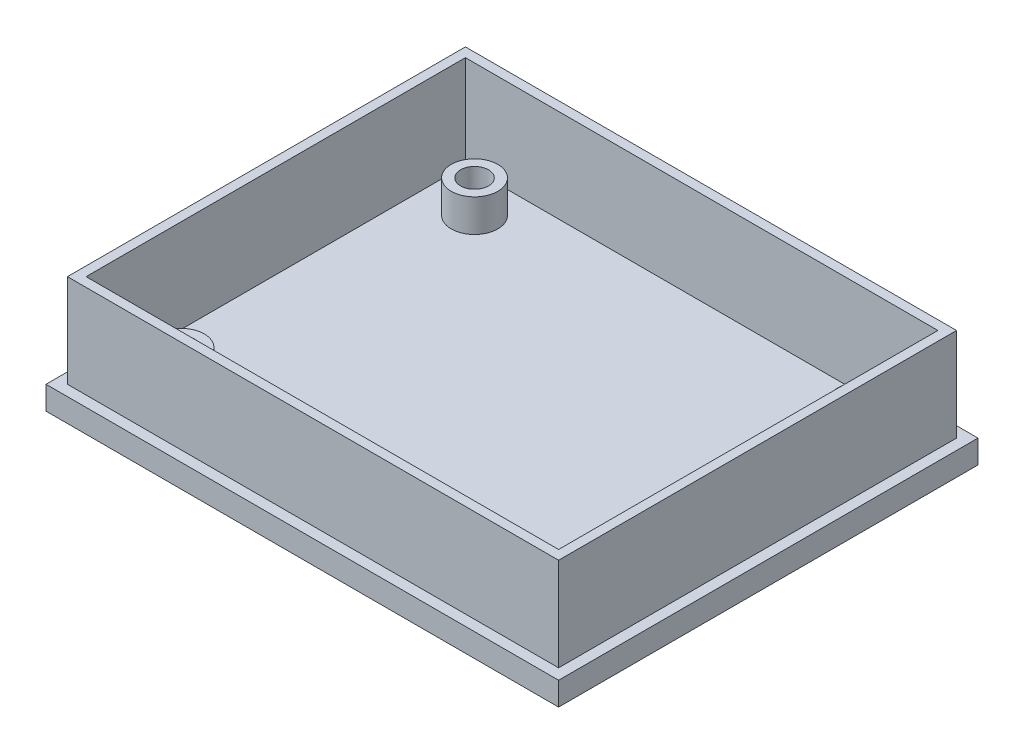
ISO-10303-21;
HEADER;
FILE_DESCRIPTION(('STEP AP214'),'2;1');
FILE_NAME('part.step','',(''),(''),'','','');
FILE_SCHEMA(('AUTOMOTIVE_DESIGN { 1 0 10303 214 1 1 1 1 }'));
ENDSEC;
DATA;
#1=APPLICATION_CONTEXT('core data for automotive mechanical design processes');
#2=APPLICATION_PROTOCOL_DEFINITION('international standard','automotive_design',2000,#1);
#3=PRODUCT_CONTEXT('',#1,'mechanical');
#4=PRODUCT('Part','Part','',(#3));
#5=PRODUCT_RELATED_PRODUCT_CATEGORY('part','',(#4));
#6=PRODUCT_DEFINITION_FORMATION('','',#4);
#7=PRODUCT_DEFINITION_CONTEXT('part definition',#1,'design');
#8=PRODUCT_DEFINITION('design','',#6,#7);
#9=PRODUCT_DEFINITION_SHAPE('','',#8);
#10=(LENGTH_UNIT() NAMED_UNIT(*) SI_UNIT(.MILLI.,.METRE.));
#11=(NAMED_UNIT(*) PLANE_ANGLE_UNIT() SI_UNIT($,.RADIAN.));
#12=(NAMED_UNIT(*) SI_UNIT($,.STERADIAN.) SOLID_ANGLE_UNIT());
#13=UNCERTAINTY_MEASURE_WITH_UNIT(LENGTH_MEASURE(1.E-05),#10,'distance_accuracy_value','');
#14=(GEOMETRIC_REPRESENTATION_CONTEXT(3) GLOBAL_UNCERTAINTY_ASSIGNED_CONTEXT((#13)) GLOBAL_UNIT_ASSIGNED_CONTEXT((#10,
#11,#12)) REPRESENTATION_CONTEXT('',''));
#15=CARTESIAN_POINT('',(0.,0.,0.));
#16=DIRECTION('',(0.,0.,1.));
#17=DIRECTION('',(1.,0.,0.));
#18=AXIS2_PLACEMENT_3D('',#15,#16,#17);
#19=CARTESIAN_POINT('',(0.,5.,0.));
#20=DIRECTION('',(0.,1.,0.));
#21=DIRECTION('',(0.,0.,1.));
#22=AXIS2_PLACEMENT_3D('',#19,#20,#21);
#23=PLANE('',#22);
#24=DIRECTION('',(-1.,0.,0.));
#25=VECTOR('',#24,1.);
#26=CARTESIAN_POINT('',(55.,5.,-45.));
#27=LINE('',#26,#25);
#28=CARTESIAN_POINT('',(55.,5.,-45.));
#29=VERTEX_POINT('',#28);
#30=CARTESIAN_POINT('',(-55.,5.,-45.));
#31=VERTEX_POINT('',#30);
#32=EDGE_CURVE('E192',#29,#31,#27,.T.);
#33=ORIENTED_EDGE('',*,*,#32,.T.);
#34=DIRECTION('',(0.,0.,1.));
#35=VECTOR('',#34,1.);
#36=CARTESIAN_POINT('',(-55.,5.,-45.));
#37=LINE('',#36,#35);
#38=CARTESIAN_POINT('',(-55.,5.,45.));
#39=VERTEX_POINT('',#38);
#40=EDGE_CURVE('E195',#31,#39,#37,.T.);
#41=ORIENTED_EDGE('',*,*,#40,.T.);
#42=DIRECTION('',(-1.,0.,0.));
#43=VECTOR('',#42,1.);
#44=CARTESIAN_POINT('',(55.,5.,45.));
#45=LINE('',#44,#43);
#46=CARTESIAN_POINT('',(55.,5.,45.));
#47=VERTEX_POINT('',#46);
#48=EDGE_CURVE('E198',#47,#39,#45,.T.);
#49=ORIENTED_EDGE('',*,*,#48,.F.);
#50=DIRECTION('',(0.,0.,1.));
#51=VECTOR('',#50,1.);
#52=CARTESIAN_POINT('',(55.,5.,-45.));
#53=LINE('',#52,#51);
#54=EDGE_CURVE('E201',#29,#47,#53,.T.);
#55=ORIENTED_EDGE('',*,*,#54,.F.);
#56=EDGE_LOOP('',(#33,#41,#49,#55));
#57=FACE_BOUND('',#56,.T.);
#58=DIRECTION('',(-1.,0.,0.));
#59=VECTOR('',#58,1.);
#60=CARTESIAN_POINT('',(52.7,5.,-42.7));
#61=LINE('',#60,#59);
#62=CARTESIAN_POINT('',(52.7,5.,-42.7));
#63=VERTEX_POINT('',#62);
#64=CARTESIAN_POINT('',(-52.7,5.,-42.7));
#65=VERTEX_POINT('',#64);
#66=EDGE_CURVE('E178',#63,#65,#61,.T.);
#67=ORIENTED_EDGE('',*,*,#66,.F.);
#68=DIRECTION('',(0.,0.,-1.));
#69=VECTOR('',#68,1.);
#70=CARTESIAN_POINT('',(52.7,5.,42.7));
#71=LINE('',#70,#69);
#72=CARTESIAN_POINT('',(52.7,5.,42.7));
#73=VERTEX_POINT('',#72);
#74=EDGE_CURVE('E141',#73,#63,#71,.T.);
#75=ORIENTED_EDGE('',*,*,#74,.F.);
#76=DIRECTION('',(1.,0.,0.));
#77=VECTOR('',#76,1.);
#78=CARTESIAN_POINT('',(-52.7,5.,42.7));
#79=LINE('',#78,#77);
#80=CARTESIAN_POINT('',(-52.7,5.,42.7));
#81=VERTEX_POINT('',#80);
#82=EDGE_CURVE('E169',#81,#73,#79,.T.);
#83=ORIENTED_EDGE('',*,*,#82,.F.);
#84=DIRECTION('',(0.,0.,1.));
#85=VECTOR('',#84,1.);
#86=CARTESIAN_POINT('',(-52.7,5.,-42.7));
#87=LINE('',#86,#85);
#88=EDGE_CURVE('E180',#65,#81,#87,.T.);
#89=ORIENTED_EDGE('',*,*,#88,.F.);
#90=EDGE_LOOP('',(#67,#75,#83,#89));
#91=FACE_BOUND('',#90,.T.);
#92=ADVANCED_FACE('F33',(#57,#91),#23,.T.);
#93=CARTESIAN_POINT('',(55.,5.,-45.));
#94=DIRECTION('',(0.,0.,1.));
#95=DIRECTION('',(1.,0.,0.));
#96=AXIS2_PLACEMENT_3D('',#93,#94,#95);
#97=PLANE('',#96);
#98=DIRECTION('',(-1.,0.,0.));
#99=VECTOR('',#98,1.);
#100=CARTESIAN_POINT('',(55.,0.,-45.));
#101=LINE('',#100,#99);
#102=CARTESIAN_POINT('',(55.,0.,-45.));
#103=VERTEX_POINT('',#102);
#104=CARTESIAN_POINT('',(-55.,0.,-45.));
#105=VERTEX_POINT('',#104);
#106=EDGE_CURVE('E191',#103,#105,#101,.T.);
#107=ORIENTED_EDGE('',*,*,#106,.T.);
#108=DIRECTION('',(0.,-1.,0.));
#109=VECTOR('',#108,1.);
#110=CARTESIAN_POINT('',(-55.,5.,-45.));
#111=LINE('',#110,#109);
#112=EDGE_CURVE('E11',#31,#105,#111,.T.);
#113=ORIENTED_EDGE('',*,*,#112,.F.);
#114=ORIENTED_EDGE('',*,*,#32,.F.);
#115=DIRECTION('',(0.,-1.,0.));
#116=VECTOR('',#115,1.);
#117=CARTESIAN_POINT('',(55.,5.,-45.));
#118=LINE('',#117,#116);
#119=EDGE_CURVE('E204',#29,#103,#118,.T.);
#120=ORIENTED_EDGE('',*,*,#119,.T.);
#121=EDGE_LOOP('',(#107,#113,#114,#120));
#122=FACE_BOUND('',#121,.T.);
#123=ADVANCED_FACE('F35',(#122),#97,.F.);
#124=CARTESIAN_POINT('',(-55.,5.,-45.));
#125=DIRECTION('',(1.,0.,0.));
#126=DIRECTION('',(0.,0.,-1.));
#127=AXIS2_PLACEMENT_3D('',#124,#125,#126);
#128=PLANE('',#127);
#129=DIRECTION('',(0.,0.,1.));
#130=VECTOR('',#129,1.);
#131=CARTESIAN_POINT('',(-55.,0.,-45.));
#132=LINE('',#131,#130);
#133=CARTESIAN_POINT('',(-55.,0.,45.));
#134=VERTEX_POINT('',#133);
#135=EDGE_CURVE('E207',#105,#134,#132,.T.);
#136=ORIENTED_EDGE('',*,*,#135,.T.);
#137=DIRECTION('',(0.,-1.,0.));
#138=VECTOR('',#137,1.);
#139=CARTESIAN_POINT('',(-55.,5.,45.));
#140=LINE('',#139,#138);
#141=EDGE_CURVE('E41',#39,#134,#140,.T.);
#142=ORIENTED_EDGE('',*,*,#141,.F.);
#143=ORIENTED_EDGE('',*,*,#40,.F.);
#144=ORIENTED_EDGE('',*,*,#112,.T.);
#145=EDGE_LOOP('',(#136,#142,#143,#144));
#146=FACE_BOUND('',#145,.T.);
#147=ADVANCED_FACE('F223',(#146),#128,.F.);
#148=CARTESIAN_POINT('',(55.,5.,45.));
#149=DIRECTION('',(0.,0.,1.));
#150=DIRECTION('',(1.,0.,0.));
#151=AXIS2_PLACEMENT_3D('',#148,#149,#150);
#152=PLANE('',#151);
#153=DIRECTION('',(-1.,0.,0.));
#154=VECTOR('',#153,1.);
#155=CARTESIAN_POINT('',(55.,0.,45.));
#156=LINE('',#155,#154);
#157=CARTESIAN_POINT('',(55.,0.,45.));
#158=VERTEX_POINT('',#157);
#159=EDGE_CURVE('E210',#158,#134,#156,.T.);
#160=ORIENTED_EDGE('',*,*,#159,.F.);
#161=DIRECTION('',(0.,-1.,0.));
#162=VECTOR('',#161,1.);
#163=CARTESIAN_POINT('',(55.,5.,45.));
#164=LINE('',#163,#162);
#165=EDGE_CURVE('E216',#47,#158,#164,.T.);
#166=ORIENTED_EDGE('',*,*,#165,.F.);
#167=ORIENTED_EDGE('',*,*,#48,.T.);
#168=ORIENTED_EDGE('',*,*,#141,.T.);
#169=EDGE_LOOP('',(#160,#166,#167,#168));
#170=FACE_BOUND('',#169,.T.);
#171=ADVANCED_FACE('F220',(#170),#152,.T.);
#172=CARTESIAN_POINT('',(55.,5.,-45.));
#173=DIRECTION('',(1.,0.,0.));
#174=DIRECTION('',(0.,0.,-1.));
#175=AXIS2_PLACEMENT_3D('',#172,#173,#174);
#176=PLANE('',#175);
#177=DIRECTION('',(0.,0.,1.));
#178=VECTOR('',#177,1.);
#179=CARTESIAN_POINT('',(55.,0.,-45.));
#180=LINE('',#179,#178);
#181=EDGE_CURVE('E196',#103,#158,#180,.T.);
#182=ORIENTED_EDGE('',*,*,#181,.F.);
#183=ORIENTED_EDGE('',*,*,#119,.F.);
#184=ORIENTED_EDGE('',*,*,#54,.T.);
#185=ORIENTED_EDGE('',*,*,#165,.T.);
#186=EDGE_LOOP('',(#182,#183,#184,#185));
#187=FACE_BOUND('',#186,.T.);
#188=ADVANCED_FACE('F230',(#187),#176,.T.);
#189=CARTESIAN_POINT('',(0.,0.,0.));
#190=DIRECTION('',(0.,1.,0.));
#191=DIRECTION('',(0.,0.,1.));
#192=AXIS2_PLACEMENT_3D('',#189,#190,#191);
#193=PLANE('',#192);
#194=ORIENTED_EDGE('',*,*,#106,.F.);
#195=ORIENTED_EDGE('',*,*,#181,.T.);
#196=ORIENTED_EDGE('',*,*,#159,.T.);
#197=ORIENTED_EDGE('',*,*,#135,.F.);
#198=EDGE_LOOP('',(#194,#195,#196,#197));
#199=FACE_BOUND('',#198,.T.);
#200=ADVANCED_FACE('F227',(#199),#193,.F.);
#201=CARTESIAN_POINT('',(0.,25.,0.));
#202=DIRECTION('',(0.,1.,0.));
#203=DIRECTION('',(0.,0.,1.));
#204=AXIS2_PLACEMENT_3D('',#201,#202,#203);
#205=PLANE('',#204);
#206=DIRECTION('',(0.,0.,-1.));
#207=VECTOR('',#206,1.);
#208=CARTESIAN_POINT('',(52.7,25.,42.7));
#209=LINE('',#208,#207);
#210=CARTESIAN_POINT('',(52.7,25.,42.7));
#211=VERTEX_POINT('',#210);
#212=CARTESIAN_POINT('',(52.7,25.,-42.7));
#213=VERTEX_POINT('',#212);
#214=EDGE_CURVE('E165',#211,#213,#209,.T.);
#215=ORIENTED_EDGE('',*,*,#214,.T.);
#216=DIRECTION('',(-1.,0.,0.));
#217=VECTOR('',#216,1.);
#218=CARTESIAN_POINT('',(52.7,25.,-42.7));
#219=LINE('',#218,#217);
#220=CARTESIAN_POINT('',(-52.7,25.,-42.7));
#221=VERTEX_POINT('',#220);
#222=EDGE_CURVE('E168',#213,#221,#219,.T.);
#223=ORIENTED_EDGE('',*,*,#222,.T.);
#224=DIRECTION('',(0.,0.,1.));
#225=VECTOR('',#224,1.);
#226=CARTESIAN_POINT('',(-52.7,25.,-42.7));
#227=LINE('',#226,#225);
#228=CARTESIAN_POINT('',(-52.7,25.,42.7));
#229=VERTEX_POINT('',#228);
#230=EDGE_CURVE('E171',#221,#229,#227,.T.);
#231=ORIENTED_EDGE('',*,*,#230,.T.);
#232=DIRECTION('',(1.,0.,0.));
#233=VECTOR('',#232,1.);
#234=CARTESIAN_POINT('',(-52.7,25.,42.7));
#235=LINE('',#234,#233);
#236=EDGE_CURVE('E173',#229,#211,#235,.T.);
#237=ORIENTED_EDGE('',*,*,#236,.T.);
#238=EDGE_LOOP('',(#215,#223,#231,#237));
#239=FACE_BOUND('',#238,.T.);
#240=DIRECTION('',(0.,0.,1.));
#241=VECTOR('',#240,1.);
#242=CARTESIAN_POINT('',(-50.7,25.,-40.7));
#243=LINE('',#242,#241);
#244=CARTESIAN_POINT('',(-50.7,25.,-40.7));
#245=VERTEX_POINT('',#244);
#246=CARTESIAN_POINT('',(-50.7,25.,40.7));
#247=VERTEX_POINT('',#246);
#248=EDGE_CURVE('E133',#245,#247,#243,.T.);
#249=ORIENTED_EDGE('',*,*,#248,.F.);
#250=DIRECTION('',(-1.,0.,0.));
#251=VECTOR('',#250,1.);
#252=CARTESIAN_POINT('',(50.7,25.,-40.7));
#253=LINE('',#252,#251);
#254=CARTESIAN_POINT('',(50.7,25.,-40.7));
#255=VERTEX_POINT('',#254);
#256=EDGE_CURVE('E124',#255,#245,#253,.T.);
#257=ORIENTED_EDGE('',*,*,#256,.F.);
#258=DIRECTION('',(0.,0.,-1.));
#259=VECTOR('',#258,1.);
#260=CARTESIAN_POINT('',(50.7,25.,40.7));
#261=LINE('',#260,#259);
#262=CARTESIAN_POINT('',(50.7,25.,40.7));
#263=VERTEX_POINT('',#262);
#264=EDGE_CURVE('E149',#263,#255,#261,.T.);
#265=ORIENTED_EDGE('',*,*,#264,.F.);
#266=DIRECTION('',(1.,0.,0.));
#267=VECTOR('',#266,1.);
#268=CARTESIAN_POINT('',(-50.7,25.,40.7));
#269=LINE('',#268,#267);
#270=EDGE_CURVE('E147',#247,#263,#269,.T.);
#271=ORIENTED_EDGE('',*,*,#270,.F.);
#272=EDGE_LOOP('',(#249,#257,#265,#271));
#273=FACE_BOUND('',#272,.T.);
#274=ADVANCED_FACE('F145',(#239,#273),#205,.T.);
#275=CARTESIAN_POINT('',(52.7,25.,42.7));
#276=DIRECTION('',(-1.,0.,0.));
#277=DIRECTION('',(0.,0.,1.));
#278=AXIS2_PLACEMENT_3D('',#275,#276,#277);
#279=PLANE('',#278);
#280=ORIENTED_EDGE('',*,*,#74,.T.);
#281=DIRECTION('',(0.,-1.,0.));
#282=VECTOR('',#281,1.);
#283=CARTESIAN_POINT('',(52.7,25.,-42.7));
#284=LINE('',#283,#282);
#285=EDGE_CURVE('E189',#213,#63,#284,.T.);
#286=ORIENTED_EDGE('',*,*,#285,.F.);
#287=ORIENTED_EDGE('',*,*,#214,.F.);
#288=DIRECTION('',(0.,-1.,0.));
#289=VECTOR('',#288,1.);
#290=CARTESIAN_POINT('',(52.7,25.,42.7));
#291=LINE('',#290,#289);
#292=EDGE_CURVE('E175',#211,#73,#291,.T.);
#293=ORIENTED_EDGE('',*,*,#292,.T.);
#294=EDGE_LOOP('',(#280,#286,#287,#293));
#295=FACE_BOUND('',#294,.T.);
#296=ADVANCED_FACE('F362',(#295),#279,.F.);
#297=CARTESIAN_POINT('',(52.7,25.,-42.7));
#298=DIRECTION('',(0.,0.,1.));
#299=DIRECTION('',(1.,0.,0.));
#300=AXIS2_PLACEMENT_3D('',#297,#298,#299);
#301=PLANE('',#300);
#302=ORIENTED_EDGE('',*,*,#66,.T.);
#303=DIRECTION('',(0.,-1.,0.));
#304=VECTOR('',#303,1.);
#305=CARTESIAN_POINT('',(-52.7,25.,-42.7));
#306=LINE('',#305,#304);
#307=EDGE_CURVE('E186',#221,#65,#306,.T.);
#308=ORIENTED_EDGE('',*,*,#307,.F.);
#309=ORIENTED_EDGE('',*,*,#222,.F.);
#310=ORIENTED_EDGE('',*,*,#285,.T.);
#311=EDGE_LOOP('',(#302,#308,#309,#310));
#312=FACE_BOUND('',#311,.T.);
#313=ADVANCED_FACE('F369',(#312),#301,.F.);
#314=CARTESIAN_POINT('',(-52.7,25.,-42.7));
#315=DIRECTION('',(1.,0.,0.));
#316=DIRECTION('',(0.,0.,-1.));
#317=AXIS2_PLACEMENT_3D('',#314,#315,#316);
#318=PLANE('',#317);
#319=ORIENTED_EDGE('',*,*,#88,.T.);
#320=DIRECTION('',(0.,-1.,0.));
#321=VECTOR('',#320,1.);
#322=CARTESIAN_POINT('',(-52.7,25.,42.7));
#323=LINE('',#322,#321);
#324=EDGE_CURVE('E48',#229,#81,#323,.T.);
#325=ORIENTED_EDGE('',*,*,#324,.F.);
#326=ORIENTED_EDGE('',*,*,#230,.F.);
#327=ORIENTED_EDGE('',*,*,#307,.T.);
#328=EDGE_LOOP('',(#319,#325,#326,#327));
#329=FACE_BOUND('',#328,.T.);
#330=ADVANCED_FACE('F366',(#329),#318,.F.);
#331=CARTESIAN_POINT('',(-52.7,25.,42.7));
#332=DIRECTION('',(0.,0.,-1.));
#333=DIRECTION('',(-1.,0.,0.));
#334=AXIS2_PLACEMENT_3D('',#331,#332,#333);
#335=PLANE('',#334);
#336=ORIENTED_EDGE('',*,*,#82,.T.);
#337=ORIENTED_EDGE('',*,*,#292,.F.);
#338=ORIENTED_EDGE('',*,*,#236,.F.);
#339=ORIENTED_EDGE('',*,*,#324,.T.);
#340=EDGE_LOOP('',(#336,#337,#338,#339));
#341=FACE_BOUND('',#340,.T.);
#342=ADVANCED_FACE('F359',(#341),#335,.F.);
#343=CARTESIAN_POINT('',(50.7,25.,-40.7));
#344=DIRECTION('',(0.,0.,1.));
#345=DIRECTION('',(1.,0.,0.));
#346=AXIS2_PLACEMENT_3D('',#343,#344,#345);
#347=PLANE('',#346);
#348=DIRECTION('',(-1.,0.,0.));
#349=VECTOR('',#348,1.);
#350=CARTESIAN_POINT('',(50.7,5.,-40.7));
#351=LINE('',#350,#349);
#352=CARTESIAN_POINT('',(50.7,5.,-40.7));
#353=VERTEX_POINT('',#352);
#354=CARTESIAN_POINT('',(-50.7,5.,-40.7));
#355=VERTEX_POINT('',#354);
#356=EDGE_CURVE('E56',#353,#355,#351,.T.);
#357=ORIENTED_EDGE('',*,*,#356,.F.);
#358=DIRECTION('',(0.,-1.,0.));
#359=VECTOR('',#358,1.);
#360=CARTESIAN_POINT('',(50.7,25.,-40.7));
#361=LINE('',#360,#359);
#362=EDGE_CURVE('E129',#255,#353,#361,.T.);
#363=ORIENTED_EDGE('',*,*,#362,.F.);
#364=ORIENTED_EDGE('',*,*,#256,.T.);
#365=DIRECTION('',(0.,-1.,0.));
#366=VECTOR('',#365,1.);
#367=CARTESIAN_POINT('',(-50.7,25.,-40.7));
#368=LINE('',#367,#366);
#369=EDGE_CURVE('E127',#245,#355,#368,.T.);
#370=ORIENTED_EDGE('',*,*,#369,.T.);
#371=EDGE_LOOP('',(#357,#363,#364,#370));
#372=FACE_BOUND('',#371,.T.);
#373=ADVANCED_FACE('F126',(#372),#347,.T.);
#374=CARTESIAN_POINT('',(-50.7,25.,-40.7));
#375=DIRECTION('',(1.,0.,0.));
#376=DIRECTION('',(0.,0.,-1.));
#377=AXIS2_PLACEMENT_3D('',#374,#375,#376);
#378=PLANE('',#377);
#379=DIRECTION('',(0.,0.,1.));
#380=VECTOR('',#379,1.);
#381=CARTESIAN_POINT('',(-50.7,5.,-40.7));
#382=LINE('',#381,#380);
#383=CARTESIAN_POINT('',(-50.7,5.,40.7));
#384=VERTEX_POINT('',#383);
#385=EDGE_CURVE('E140',#355,#384,#382,.T.);
#386=ORIENTED_EDGE('',*,*,#385,.F.);
#387=ORIENTED_EDGE('',*,*,#369,.F.);
#388=ORIENTED_EDGE('',*,*,#248,.T.);
#389=DIRECTION('',(0.,-1.,0.));
#390=VECTOR('',#389,1.);
#391=CARTESIAN_POINT('',(-50.7,25.,40.7));
#392=LINE('',#391,#390);
#393=EDGE_CURVE('E142',#247,#384,#392,.T.);
#394=ORIENTED_EDGE('',*,*,#393,.T.);
#395=EDGE_LOOP('',(#386,#387,#388,#394));
#396=FACE_BOUND('',#395,.T.);
#397=ADVANCED_FACE('F137',(#396),#378,.T.);
#398=CARTESIAN_POINT('',(-50.7,25.,40.7));
#399=DIRECTION('',(0.,0.,-1.));
#400=DIRECTION('',(-1.,0.,0.));
#401=AXIS2_PLACEMENT_3D('',#398,#399,#400);
#402=PLANE('',#401);
#403=DIRECTION('',(1.,0.,0.));
#404=VECTOR('',#403,1.);
#405=CARTESIAN_POINT('',(-50.7,5.,40.7));
#406=LINE('',#405,#404);
#407=CARTESIAN_POINT('',(50.7,5.,40.7));
#408=VERTEX_POINT('',#407);
#409=EDGE_CURVE('E157',#384,#408,#406,.T.);
#410=ORIENTED_EDGE('',*,*,#409,.F.);
#411=ORIENTED_EDGE('',*,*,#393,.F.);
#412=ORIENTED_EDGE('',*,*,#270,.T.);
#413=DIRECTION('',(0.,-1.,0.));
#414=VECTOR('',#413,1.);
#415=CARTESIAN_POINT('',(50.7,25.,40.7));
#416=LINE('',#415,#414);
#417=EDGE_CURVE('E161',#263,#408,#416,.T.);
#418=ORIENTED_EDGE('',*,*,#417,.T.);
#419=EDGE_LOOP('',(#410,#411,#412,#418));
#420=FACE_BOUND('',#419,.T.);
#421=ADVANCED_FACE('F258',(#420),#402,.T.);
#422=CARTESIAN_POINT('',(50.7,25.,40.7));
#423=DIRECTION('',(-1.,0.,0.));
#424=DIRECTION('',(0.,0.,1.));
#425=AXIS2_PLACEMENT_3D('',#422,#423,#424);
#426=PLANE('',#425);
#427=DIRECTION('',(0.,0.,-1.));
#428=VECTOR('',#427,1.);
#429=CARTESIAN_POINT('',(50.7,5.,40.7));
#430=LINE('',#429,#428);
#431=EDGE_CURVE('E134',#408,#353,#430,.T.);
#432=ORIENTED_EDGE('',*,*,#431,.F.);
#433=ORIENTED_EDGE('',*,*,#417,.F.);
#434=ORIENTED_EDGE('',*,*,#264,.T.);
#435=ORIENTED_EDGE('',*,*,#362,.T.);
#436=EDGE_LOOP('',(#432,#433,#434,#435));
#437=FACE_BOUND('',#436,.T.);
#438=ADVANCED_FACE('F249',(#437),#426,.T.);
#439=CARTESIAN_POINT('',(42.6196993256001,5.,-32.3417613639737));
#440=DIRECTION('',(0.,1.,0.));
#441=DIRECTION('',(0.,0.,1.));
#442=AXIS2_PLACEMENT_3D('',#439,#440,#441);
#443=CIRCLE('',#442,5.);
#444=CARTESIAN_POINT('',(42.6196993256001,5.,-27.3417613639737));
#445=VERTEX_POINT('',#444);
#446=EDGE_CURVE('E264',#445,#445,#443,.T.);
#447=ORIENTED_EDGE('',*,*,#446,.F.);
#448=EDGE_LOOP('',(#447));
#449=FACE_BOUND('',#448,.T.);
#450=CARTESIAN_POINT('',(42.6196993256001,5.,30.6582386360263));
#451=DIRECTION('',(0.,1.,0.));
#452=DIRECTION('',(0.,0.,1.));
#453=AXIS2_PLACEMENT_3D('',#450,#451,#452);
#454=CIRCLE('',#453,5.);
#455=CARTESIAN_POINT('',(42.6196993256001,5.,35.6582386360263));
#456=VERTEX_POINT('',#455);
#457=EDGE_CURVE('E268',#456,#456,#454,.T.);
#458=ORIENTED_EDGE('',*,*,#457,.F.);
#459=EDGE_LOOP('',(#458));
#460=FACE_BOUND('',#459,.T.);
#461=CARTESIAN_POINT('',(-40.3803006743999,5.,30.6582386360263));
#462=DIRECTION('',(0.,1.,0.));
#463=DIRECTION('',(0.,0.,1.));
#464=AXIS2_PLACEMENT_3D('',#461,#462,#463);
#465=CIRCLE('',#464,5.);
#466=CARTESIAN_POINT('',(-40.3803006743999,5.,35.6582386360263));
#467=VERTEX_POINT('',#466);
#468=EDGE_CURVE('E272',#467,#467,#465,.T.);
#469=ORIENTED_EDGE('',*,*,#468,.F.);
#470=EDGE_LOOP('',(#469));
#471=FACE_BOUND('',#470,.T.);
#472=CARTESIAN_POINT('',(-40.3803006743999,5.,-32.3417613639737));
#473=DIRECTION('',(0.,1.,0.));
#474=DIRECTION('',(0.,0.,1.));
#475=AXIS2_PLACEMENT_3D('',#472,#473,#474);
#476=CIRCLE('',#475,5.);
#477=CARTESIAN_POINT('',(-40.3803006743999,5.,-27.3417613639737));
#478=VERTEX_POINT('',#477);
#479=EDGE_CURVE('E275',#478,#478,#476,.T.);
#480=ORIENTED_EDGE('',*,*,#479,.F.);
#481=EDGE_LOOP('',(#480));
#482=FACE_BOUND('',#481,.T.);
#483=ORIENTED_EDGE('',*,*,#356,.T.);
#484=ORIENTED_EDGE('',*,*,#385,.T.);
#485=ORIENTED_EDGE('',*,*,#409,.T.);
#486=ORIENTED_EDGE('',*,*,#431,.T.);
#487=EDGE_LOOP('',(#483,#484,#485,#486));
#488=FACE_BOUND('',#487,.T.);
#489=ADVANCED_FACE('F242',(#449,#460,#471,#482,#488),#23,.T.);
#490=CARTESIAN_POINT('',(-40.3803006743999,12.,-32.3417613639737));
#491=DIRECTION('',(0.,-1.,0.));
#492=DIRECTION('',(0.,0.,-1.));
#493=AXIS2_PLACEMENT_3D('',#490,#491,#492);
#494=CYLINDRICAL_SURFACE('',#493,5.);
#495=CARTESIAN_POINT('',(-40.3803006743999,12.,-32.3417613639737));
#496=DIRECTION('',(0.,1.,0.));
#497=DIRECTION('',(0.,0.,1.));
#498=AXIS2_PLACEMENT_3D('',#495,#496,#497);
#499=CIRCLE('',#498,5.);
#500=CARTESIAN_POINT('',(-40.3803006743999,12.,-27.3417613639737));
#501=VERTEX_POINT('',#500);
#502=EDGE_CURVE('E155',#501,#501,#499,.T.);
#503=ORIENTED_EDGE('',*,*,#502,.F.);
#504=EDGE_LOOP('',(#503));
#505=FACE_BOUND('',#504,.T.);
#506=ORIENTED_EDGE('',*,*,#479,.T.);
#507=EDGE_LOOP('',(#506));
#508=FACE_BOUND('',#507,.T.);
#509=ADVANCED_FACE('F248',(#505,#508),#494,.T.);
#510=CARTESIAN_POINT('',(-40.3803006743999,12.,-32.3417613639737));
#511=DIRECTION('',(0.,1.,0.));
#512=DIRECTION('',(0.,0.,1.));
#513=AXIS2_PLACEMENT_3D('',#510,#511,#512);
#514=PLANE('',#513);
#515=CARTESIAN_POINT('',(-40.3803006743999,12.,-32.3417613639737));
#516=DIRECTION('',(0.,1.,0.));
#517=DIRECTION('',(0.,0.,1.));
#518=AXIS2_PLACEMENT_3D('',#515,#516,#517);
#519=CIRCLE('',#518,2.99999999999999);
#520=CARTESIAN_POINT('',(-40.3803006743999,12.,-29.3417613639737));
#521=VERTEX_POINT('',#520);
#522=EDGE_CURVE('E299',#521,#521,#519,.T.);
#523=ORIENTED_EDGE('',*,*,#522,.F.);
#524=EDGE_LOOP('',(#523));
#525=FACE_BOUND('',#524,.T.);
#526=ORIENTED_EDGE('',*,*,#502,.T.);
#527=EDGE_LOOP('',(#526));
#528=FACE_BOUND('',#527,.T.);
#529=ADVANCED_FACE('F255',(#525,#528),#514,.T.);
#530=CARTESIAN_POINT('',(-40.3803006743999,12.,30.6582386360263));
#531=DIRECTION('',(0.,-1.,0.));
#532=DIRECTION('',(0.,0.,-1.));
#533=AXIS2_PLACEMENT_3D('',#530,#531,#532);
#534=CYLINDRICAL_SURFACE('',#533,5.);
#535=CARTESIAN_POINT('',(-40.3803006743999,12.,30.6582386360263));
#536=DIRECTION('',(0.,1.,0.));
#537=DIRECTION('',(0.,0.,1.));
#538=AXIS2_PLACEMENT_3D('',#535,#536,#537);
#539=CIRCLE('',#538,5.);
#540=CARTESIAN_POINT('',(-40.3803006743999,12.,35.6582386360263));
#541=VERTEX_POINT('',#540);
#542=EDGE_CURVE('E277',#541,#541,#539,.T.);
#543=ORIENTED_EDGE('',*,*,#542,.F.);
#544=EDGE_LOOP('',(#543));
#545=FACE_BOUND('',#544,.T.);
#546=ORIENTED_EDGE('',*,*,#468,.T.);
#547=EDGE_LOOP('',(#546));
#548=FACE_BOUND('',#547,.T.);
#549=ADVANCED_FACE('F341',(#545,#548),#534,.T.);
#550=CARTESIAN_POINT('',(-40.3803006743999,12.,30.6582386360263));
#551=DIRECTION('',(0.,1.,0.));
#552=DIRECTION('',(0.,0.,1.));
#553=AXIS2_PLACEMENT_3D('',#550,#551,#552);
#554=PLANE('',#553);
#555=CARTESIAN_POINT('',(-40.3803006743999,12.,30.6582386360263));
#556=DIRECTION('',(0.,1.,0.));
#557=DIRECTION('',(0.,0.,1.));
#558=AXIS2_PLACEMENT_3D('',#555,#556,#557);
#559=CIRCLE('',#558,2.99999999999999);
#560=CARTESIAN_POINT('',(-40.3803006743999,12.,33.6582386360263));
#561=VERTEX_POINT('',#560);
#562=EDGE_CURVE('E293',#561,#561,#559,.T.);
#563=ORIENTED_EDGE('',*,*,#562,.F.);
#564=EDGE_LOOP('',(#563));
#565=FACE_BOUND('',#564,.T.);
#566=ORIENTED_EDGE('',*,*,#542,.T.);
#567=EDGE_LOOP('',(#566));
#568=FACE_BOUND('',#567,.T.);
#569=ADVANCED_FACE('F336',(#565,#568),#554,.T.);
#570=CARTESIAN_POINT('',(42.6196993256001,12.,30.6582386360263));
#571=DIRECTION('',(0.,-1.,0.));
#572=DIRECTION('',(0.,0.,-1.));
#573=AXIS2_PLACEMENT_3D('',#570,#571,#572);
#574=CYLINDRICAL_SURFACE('',#573,5.);
#575=CARTESIAN_POINT('',(42.6196993256001,12.,30.6582386360263));
#576=DIRECTION('',(0.,1.,0.));
#577=DIRECTION('',(0.,0.,1.));
#578=AXIS2_PLACEMENT_3D('',#575,#576,#577);
#579=CIRCLE('',#578,5.);
#580=CARTESIAN_POINT('',(42.6196993256001,12.,35.6582386360263));
#581=VERTEX_POINT('',#580);
#582=EDGE_CURVE('E283',#581,#581,#579,.T.);
#583=ORIENTED_EDGE('',*,*,#582,.F.);
#584=EDGE_LOOP('',(#583));
#585=FACE_BOUND('',#584,.T.);
#586=ORIENTED_EDGE('',*,*,#457,.T.);
#587=EDGE_LOOP('',(#586));
#588=FACE_BOUND('',#587,.T.);
#589=ADVANCED_FACE('F330',(#585,#588),#574,.T.);
#590=CARTESIAN_POINT('',(42.6196993256001,12.,30.6582386360263));
#591=DIRECTION('',(0.,1.,0.));
#592=DIRECTION('',(0.,0.,1.));
#593=AXIS2_PLACEMENT_3D('',#590,#591,#592);
#594=PLANE('',#593);
#595=CARTESIAN_POINT('',(42.6196993256001,12.,30.6582386360263));
#596=DIRECTION('',(0.,1.,0.));
#597=DIRECTION('',(0.,0.,1.));
#598=AXIS2_PLACEMENT_3D('',#595,#596,#597);
#599=CIRCLE('',#598,2.99999999999999);
#600=CARTESIAN_POINT('',(42.6196993256001,12.,33.6582386360263));
#601=VERTEX_POINT('',#600);
#602=EDGE_CURVE('E311',#601,#601,#599,.T.);
#603=ORIENTED_EDGE('',*,*,#602,.F.);
#604=EDGE_LOOP('',(#603));
#605=FACE_BOUND('',#604,.T.);
#606=ORIENTED_EDGE('',*,*,#582,.T.);
#607=EDGE_LOOP('',(#606));
#608=FACE_BOUND('',#607,.T.);
#609=ADVANCED_FACE('F326',(#605,#608),#594,.T.);
#610=CARTESIAN_POINT('',(42.6196993256001,12.,-32.3417613639737));
#611=DIRECTION('',(0.,-1.,0.));
#612=DIRECTION('',(0.,0.,-1.));
#613=AXIS2_PLACEMENT_3D('',#610,#611,#612);
#614=CYLINDRICAL_SURFACE('',#613,5.);
#615=CARTESIAN_POINT('',(42.6196993256001,12.,-32.3417613639737));
#616=DIRECTION('',(0.,1.,0.));
#617=DIRECTION('',(0.,0.,1.));
#618=AXIS2_PLACEMENT_3D('',#615,#616,#617);
#619=CIRCLE('',#618,5.);
#620=CARTESIAN_POINT('',(42.6196993256001,12.,-27.3417613639737));
#621=VERTEX_POINT('',#620);
#622=EDGE_CURVE('E286',#621,#621,#619,.T.);
#623=ORIENTED_EDGE('',*,*,#622,.F.);
#624=EDGE_LOOP('',(#623));
#625=FACE_BOUND('',#624,.T.);
#626=ORIENTED_EDGE('',*,*,#446,.T.);
#627=EDGE_LOOP('',(#626));
#628=FACE_BOUND('',#627,.T.);
#629=ADVANCED_FACE('F329',(#625,#628),#614,.T.);
#630=CARTESIAN_POINT('',(42.6196993256001,12.,-32.3417613639737));
#631=DIRECTION('',(0.,1.,0.));
#632=DIRECTION('',(0.,0.,1.));
#633=AXIS2_PLACEMENT_3D('',#630,#631,#632);
#634=PLANE('',#633);
#635=CARTESIAN_POINT('',(42.6196993256001,12.,-32.3417613639737));
#636=DIRECTION('',(0.,1.,0.));
#637=DIRECTION('',(0.,0.,1.));
#638=AXIS2_PLACEMENT_3D('',#635,#636,#637);
#639=CIRCLE('',#638,2.99999999999999);
#640=CARTESIAN_POINT('',(42.6196993256001,12.,-29.3417613639737));
#641=VERTEX_POINT('',#640);
#642=EDGE_CURVE('E305',#641,#641,#639,.T.);
#643=ORIENTED_EDGE('',*,*,#642,.F.);
#644=EDGE_LOOP('',(#643));
#645=FACE_BOUND('',#644,.T.);
#646=ORIENTED_EDGE('',*,*,#622,.T.);
#647=EDGE_LOOP('',(#646));
#648=FACE_BOUND('',#647,.T.);
#649=ADVANCED_FACE('F451',(#645,#648),#634,.T.);
#650=CARTESIAN_POINT('',(42.6196993256001,6.99999999999999,-32.3417613639737));
#651=DIRECTION('',(0.,1.,0.));
#652=DIRECTION('',(0.,0.,1.));
#653=AXIS2_PLACEMENT_3D('',#650,#651,#652);
#654=CYLINDRICAL_SURFACE('',#653,2.99999999999999);
#655=CARTESIAN_POINT('',(42.6196993256001,6.99999999999999,-32.3417613639737));
#656=DIRECTION('',(0.,1.,0.));
#657=DIRECTION('',(0.,0.,1.));
#658=AXIS2_PLACEMENT_3D('',#655,#656,#657);
#659=CIRCLE('',#658,2.99999999999999);
#660=CARTESIAN_POINT('',(42.6196993256001,6.99999999999999,-29.3417613639737));
#661=VERTEX_POINT('',#660);
#662=EDGE_CURVE('E308',#661,#661,#659,.T.);
#663=ORIENTED_EDGE('',*,*,#662,.F.);
#664=EDGE_LOOP('',(#663));
#665=FACE_BOUND('',#664,.T.);
#666=ORIENTED_EDGE('',*,*,#642,.T.);
#667=EDGE_LOOP('',(#666));
#668=FACE_BOUND('',#667,.T.);
#669=ADVANCED_FACE('F475',(#665,#668),#654,.F.);
#670=CARTESIAN_POINT('',(42.6196993256001,6.99999999999999,-32.3417613639737));
#671=DIRECTION('',(0.,1.,0.));
#672=DIRECTION('',(0.,0.,1.));
#673=AXIS2_PLACEMENT_3D('',#670,#671,#672);
#674=PLANE('',#673);
#675=ORIENTED_EDGE('',*,*,#662,.T.);
#676=EDGE_LOOP('',(#675));
#677=FACE_BOUND('',#676,.T.);
#678=ADVANCED_FACE('F322',(#677),#674,.T.);
#679=CARTESIAN_POINT('',(42.6196993256001,6.99999999999999,30.6582386360263));
#680=DIRECTION('',(0.,1.,0.));
#681=DIRECTION('',(0.,0.,1.));
#682=AXIS2_PLACEMENT_3D('',#679,#680,#681);
#683=CYLINDRICAL_SURFACE('',#682,2.99999999999999);
#684=CARTESIAN_POINT('',(42.6196993256001,6.99999999999999,30.6582386360263));
#685=DIRECTION('',(0.,1.,0.));
#686=DIRECTION('',(0.,0.,1.));
#687=AXIS2_PLACEMENT_3D('',#684,#685,#686);
#688=CIRCLE('',#687,2.99999999999999);
#689=CARTESIAN_POINT('',(42.6196993256001,6.99999999999999,33.6582386360263));
#690=VERTEX_POINT('',#689);
#691=EDGE_CURVE('E296',#690,#690,#688,.T.);
#692=ORIENTED_EDGE('',*,*,#691,.F.);
#693=EDGE_LOOP('',(#692));
#694=FACE_BOUND('',#693,.T.);
#695=ORIENTED_EDGE('',*,*,#602,.T.);
#696=EDGE_LOOP('',(#695));
#697=FACE_BOUND('',#696,.T.);
#698=ADVANCED_FACE('F319',(#694,#697),#683,.F.);
#699=CARTESIAN_POINT('',(42.6196993256001,6.99999999999999,30.6582386360263));
#700=DIRECTION('',(0.,1.,0.));
#701=DIRECTION('',(0.,0.,1.));
#702=AXIS2_PLACEMENT_3D('',#699,#700,#701);
#703=PLANE('',#702);
#704=ORIENTED_EDGE('',*,*,#691,.T.);
#705=EDGE_LOOP('',(#704));
#706=FACE_BOUND('',#705,.T.);
#707=ADVANCED_FACE('F317',(#706),#703,.T.);
#708=CARTESIAN_POINT('',(-40.3803006743999,6.99999999999999,30.6582386360263));
#709=DIRECTION('',(0.,1.,0.));
#710=DIRECTION('',(0.,0.,1.));
#711=AXIS2_PLACEMENT_3D('',#708,#709,#710);
#712=CYLINDRICAL_SURFACE('',#711,2.99999999999999);
#713=CARTESIAN_POINT('',(-40.3803006743999,6.99999999999999,30.6582386360263));
#714=DIRECTION('',(0.,1.,0.));
#715=DIRECTION('',(0.,0.,1.));
#716=AXIS2_PLACEMENT_3D('',#713,#714,#715);
#717=CIRCLE('',#716,2.99999999999999);
#718=CARTESIAN_POINT('',(-40.3803006743999,6.99999999999999,33.6582386360263));
#719=VERTEX_POINT('',#718);
#720=EDGE_CURVE('E290',#719,#719,#717,.T.);
#721=ORIENTED_EDGE('',*,*,#720,.F.);
#722=EDGE_LOOP('',(#721));
#723=FACE_BOUND('',#722,.T.);
#724=ORIENTED_EDGE('',*,*,#562,.T.);
#725=EDGE_LOOP('',(#724));
#726=FACE_BOUND('',#725,.T.);
#727=ADVANCED_FACE('F509',(#723,#726),#712,.F.);
#728=CARTESIAN_POINT('',(-40.3803006743999,6.99999999999999,30.6582386360263));
#729=DIRECTION('',(0.,1.,0.));
#730=DIRECTION('',(0.,0.,1.));
#731=AXIS2_PLACEMENT_3D('',#728,#729,#730);
#732=PLANE('',#731);
#733=ORIENTED_EDGE('',*,*,#720,.T.);
#734=EDGE_LOOP('',(#733));
#735=FACE_BOUND('',#734,.T.);
#736=ADVANCED_FACE('F518',(#735),#732,.T.);
#737=CARTESIAN_POINT('',(-40.3803006743999,6.99999999999999,-32.3417613639737));
#738=DIRECTION('',(0.,1.,0.));
#739=DIRECTION('',(0.,0.,1.));
#740=AXIS2_PLACEMENT_3D('',#737,#738,#739);
#741=CYLINDRICAL_SURFACE('',#740,2.99999999999999);
#742=CARTESIAN_POINT('',(-40.3803006743999,6.99999999999999,-32.3417613639737));
#743=DIRECTION('',(0.,1.,0.));
#744=DIRECTION('',(0.,0.,1.));
#745=AXIS2_PLACEMENT_3D('',#742,#743,#744);
#746=CIRCLE('',#745,2.99999999999999);
#747=CARTESIAN_POINT('',(-40.3803006743999,6.99999999999999,-29.3417613639737));
#748=VERTEX_POINT('',#747);
#749=EDGE_CURVE('E302',#748,#748,#746,.T.);
#750=ORIENTED_EDGE('',*,*,#749,.F.);
#751=EDGE_LOOP('',(#750));
#752=FACE_BOUND('',#751,.T.);
#753=ORIENTED_EDGE('',*,*,#522,.T.);
#754=EDGE_LOOP('',(#753));
#755=FACE_BOUND('',#754,.T.);
#756=ADVANCED_FACE('F528',(#752,#755),#741,.F.);
#757=CARTESIAN_POINT('',(-40.3803006743999,6.99999999999999,-32.3417613639737));
#758=DIRECTION('',(0.,1.,0.));
#759=DIRECTION('',(0.,0.,1.));
#760=AXIS2_PLACEMENT_3D('',#757,#758,#759);
#761=PLANE('',#760);
#762=ORIENTED_EDGE('',*,*,#749,.T.);
#763=EDGE_LOOP('',(#762));
#764=FACE_BOUND('',#763,.T.);
#765=ADVANCED_FACE('F538',(#764),#761,.T.);
#766=CLOSED_SHELL('',(#92,#123,#147,#171,#188,#200,#274,#296,#313,#330,#342,#373,#397,#421,#438,
#489,#509,#529,#549,#569,#589,#609,#629,#649,#669,#678,#698,#707,#727,#736,#756,#765));
#767=MANIFOLD_SOLID_BREP('B2',#766);
#768=ADVANCED_BREP_SHAPE_REPRESENTATION('',(#18,#767),#14);
#769=SHAPE_DEFINITION_REPRESENTATION(#9,#768);
ENDSEC;
END-ISO-10303-21;
